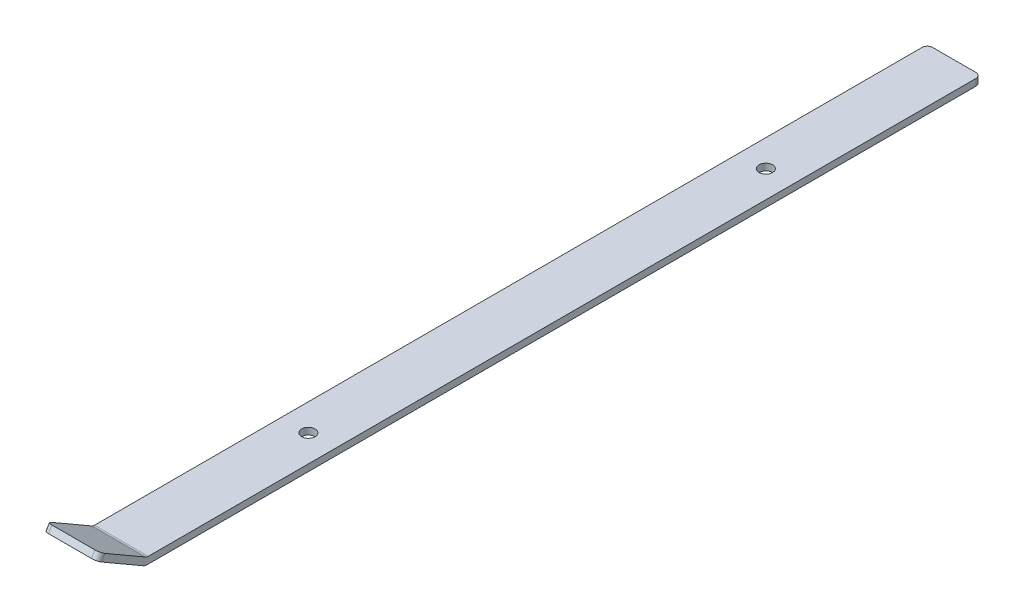
ISO-10303-21;
HEADER;
FILE_DESCRIPTION(('STEP AP214'),'2;1');
FILE_NAME('part.step','',(''),(''),'','','');
FILE_SCHEMA(('AUTOMOTIVE_DESIGN { 1 0 10303 214 1 1 1 1 }'));
ENDSEC;
DATA;
#1=APPLICATION_CONTEXT('core data for automotive mechanical design processes');
#2=APPLICATION_PROTOCOL_DEFINITION('international standard','automotive_design',2000,#1);
#3=PRODUCT_CONTEXT('',#1,'mechanical');
#4=PRODUCT('Part','Part','',(#3));
#5=PRODUCT_RELATED_PRODUCT_CATEGORY('part','',(#4));
#6=PRODUCT_DEFINITION_FORMATION('','',#4);
#7=PRODUCT_DEFINITION_CONTEXT('part definition',#1,'design');
#8=PRODUCT_DEFINITION('design','',#6,#7);
#9=PRODUCT_DEFINITION_SHAPE('','',#8);
#10=(LENGTH_UNIT() NAMED_UNIT(*) SI_UNIT(.MILLI.,.METRE.));
#11=(NAMED_UNIT(*) PLANE_ANGLE_UNIT() SI_UNIT($,.RADIAN.));
#12=(NAMED_UNIT(*) SI_UNIT($,.STERADIAN.) SOLID_ANGLE_UNIT());
#13=UNCERTAINTY_MEASURE_WITH_UNIT(LENGTH_MEASURE(1.E-05),#10,'distance_accuracy_value','');
#14=(GEOMETRIC_REPRESENTATION_CONTEXT(3) GLOBAL_UNCERTAINTY_ASSIGNED_CONTEXT((#13)) GLOBAL_UNIT_ASSIGNED_CONTEXT((#10,
#11,#12)) REPRESENTATION_CONTEXT('',''));
#15=CARTESIAN_POINT('',(0.,0.,0.));
#16=DIRECTION('',(0.,0.,1.));
#17=DIRECTION('',(1.,0.,0.));
#18=AXIS2_PLACEMENT_3D('',#15,#16,#17);
#19=CARTESIAN_POINT('',(25.4,0.,0.));
#20=DIRECTION('',(0.,-1.,0.));
#21=DIRECTION('',(0.,0.,-1.));
#22=AXIS2_PLACEMENT_3D('',#19,#20,#21);
#23=PLANE('',#22);
#24=CARTESIAN_POINT('',(12.7,0.,-88.9));
#25=DIRECTION('',(0.,1.,0.));
#26=DIRECTION('',(0.,0.,1.));
#27=AXIS2_PLACEMENT_3D('',#24,#25,#26);
#28=CIRCLE('',#27,3.175);
#29=CARTESIAN_POINT('',(12.7,0.,-85.725));
#30=VERTEX_POINT('',#29);
#31=EDGE_CURVE('E280',#30,#30,#28,.T.);
#32=ORIENTED_EDGE('',*,*,#31,.F.);
#33=EDGE_LOOP('',(#32));
#34=FACE_BOUND('',#33,.T.);
#35=CARTESIAN_POINT('',(12.7,0.,-304.8));
#36=DIRECTION('',(0.,1.,0.));
#37=DIRECTION('',(0.,0.,1.));
#38=AXIS2_PLACEMENT_3D('',#35,#36,#37);
#39=CIRCLE('',#38,3.175);
#40=CARTESIAN_POINT('',(12.7,0.,-301.625));
#41=VERTEX_POINT('',#40);
#42=EDGE_CURVE('E272',#41,#41,#39,.T.);
#43=ORIENTED_EDGE('',*,*,#42,.F.);
#44=EDGE_LOOP('',(#43));
#45=FACE_BOUND('',#44,.T.);
#46=DIRECTION('',(-1.,0.,0.));
#47=VECTOR('',#46,1.);
#48=CARTESIAN_POINT('',(25.4,0.,-393.7));
#49=LINE('',#48,#47);
#50=CARTESIAN_POINT('',(22.86,0.,-393.7));
#51=VERTEX_POINT('',#50);
#52=CARTESIAN_POINT('',(2.54,0.,-393.7));
#53=VERTEX_POINT('',#52);
#54=EDGE_CURVE('E162',#51,#53,#49,.T.);
#55=ORIENTED_EDGE('',*,*,#54,.T.);
#56=CARTESIAN_POINT('',(2.54,0.,-391.16));
#57=DIRECTION('',(0.,-1.,0.));
#58=DIRECTION('',(0.,0.,-1.));
#59=AXIS2_PLACEMENT_3D('',#56,#57,#58);
#60=CIRCLE('',#59,2.54);
#61=CARTESIAN_POINT('',(0.,0.,-391.16));
#62=VERTEX_POINT('',#61);
#63=EDGE_CURVE('E211',#53,#62,#60,.F.);
#64=ORIENTED_EDGE('',*,*,#63,.T.);
#65=DIRECTION('',(0.,0.,1.));
#66=VECTOR('',#65,1.);
#67=CARTESIAN_POINT('',(0.,0.,0.));
#68=LINE('',#67,#66);
#69=CARTESIAN_POINT('',(0.,0.,-0.680590948775043));
#70=VERTEX_POINT('',#69);
#71=EDGE_CURVE('E166',#62,#70,#68,.T.);
#72=ORIENTED_EDGE('',*,*,#71,.T.);
#73=DIRECTION('',(-1.,0.,0.));
#74=VECTOR('',#73,1.);
#75=CARTESIAN_POINT('',(25.4,0.,-0.680590948775043));
#76=LINE('',#75,#74);
#77=CARTESIAN_POINT('',(25.4,0.,-0.680590948775043));
#78=VERTEX_POINT('',#77);
#79=EDGE_CURVE('E205',#70,#78,#76,.F.);
#80=ORIENTED_EDGE('',*,*,#79,.T.);
#81=DIRECTION('',(0.,0.,1.));
#82=VECTOR('',#81,1.);
#83=CARTESIAN_POINT('',(25.4,0.,0.));
#84=LINE('',#83,#82);
#85=CARTESIAN_POINT('',(25.4,0.,-391.16));
#86=VERTEX_POINT('',#85);
#87=EDGE_CURVE('E183',#86,#78,#84,.T.);
#88=ORIENTED_EDGE('',*,*,#87,.F.);
#89=CARTESIAN_POINT('',(22.86,0.,-391.16));
#90=DIRECTION('',(0.,-1.,0.));
#91=DIRECTION('',(0.,0.,-1.));
#92=AXIS2_PLACEMENT_3D('',#89,#90,#91);
#93=CIRCLE('',#92,2.54);
#94=EDGE_CURVE('E208',#86,#51,#93,.F.);
#95=ORIENTED_EDGE('',*,*,#94,.T.);
#96=EDGE_LOOP('',(#55,#64,#72,#80,#88,#95));
#97=FACE_BOUND('',#96,.T.);
#98=ADVANCED_FACE('F38',(#34,#45,#97),#23,.F.);
#99=CARTESIAN_POINT('',(25.4,0.,0.));
#100=DIRECTION('',(0.,-0.866025403784442,0.499999999999995));
#101=DIRECTION('',(0.,-0.499999999999995,-0.866025403784442));
#102=AXIS2_PLACEMENT_3D('',#99,#100,#101);
#103=PLANE('',#102);
#104=DIRECTION('',(0.,0.499999999999995,0.866025403784442));
#105=VECTOR('',#104,1.);
#106=CARTESIAN_POINT('',(0.,0.,0.));
#107=LINE('',#106,#105);
#108=CARTESIAN_POINT('',(0.,0.340295474387518,0.589409051224943));
#109=VERTEX_POINT('',#108);
#110=CARTESIAN_POINT('',(0.,11.4299999999999,19.7973407305123));
#111=VERTEX_POINT('',#110);
#112=EDGE_CURVE('E170',#109,#111,#107,.T.);
#113=ORIENTED_EDGE('',*,*,#112,.T.);
#114=CARTESIAN_POINT('',(2.54,11.4299999999999,19.7973407305123));
#115=DIRECTION('',(0.,-0.866025403784442,0.499999999999995));
#116=DIRECTION('',(0.,-0.499999999999995,-0.866025403784442));
#117=AXIS2_PLACEMENT_3D('',#114,#115,#116);
#118=CIRCLE('',#117,2.54);
#119=CARTESIAN_POINT('',(2.54,12.6999999999999,21.9970452561248));
#120=VERTEX_POINT('',#119);
#121=EDGE_CURVE('E54',#111,#120,#118,.F.);
#122=ORIENTED_EDGE('',*,*,#121,.T.);
#123=DIRECTION('',(-1.,0.,0.));
#124=VECTOR('',#123,1.);
#125=CARTESIAN_POINT('',(25.4,12.6999999999999,21.9970452561248));
#126=LINE('',#125,#124);
#127=CARTESIAN_POINT('',(22.86,12.6999999999999,21.9970452561248));
#128=VERTEX_POINT('',#127);
#129=EDGE_CURVE('E195',#128,#120,#126,.T.);
#130=ORIENTED_EDGE('',*,*,#129,.F.);
#131=CARTESIAN_POINT('',(22.86,11.4299999999999,19.7973407305123));
#132=DIRECTION('',(0.,-0.866025403784442,0.499999999999995));
#133=DIRECTION('',(0.,-0.499999999999995,-0.866025403784442));
#134=AXIS2_PLACEMENT_3D('',#131,#132,#133);
#135=CIRCLE('',#134,2.54);
#136=CARTESIAN_POINT('',(25.4,11.4299999999999,19.7973407305123));
#137=VERTEX_POINT('',#136);
#138=EDGE_CURVE('E248',#128,#137,#135,.F.);
#139=ORIENTED_EDGE('',*,*,#138,.T.);
#140=DIRECTION('',(0.,0.499999999999995,0.866025403784442));
#141=VECTOR('',#140,1.);
#142=CARTESIAN_POINT('',(25.4,0.,0.));
#143=LINE('',#142,#141);
#144=CARTESIAN_POINT('',(25.4,0.340295474387518,0.589409051224943));
#145=VERTEX_POINT('',#144);
#146=EDGE_CURVE('E141',#145,#137,#143,.T.);
#147=ORIENTED_EDGE('',*,*,#146,.F.);
#148=DIRECTION('',(-1.,0.,0.));
#149=VECTOR('',#148,1.);
#150=CARTESIAN_POINT('',(0.,0.340295474387518,0.589409051224943));
#151=LINE('',#150,#149);
#152=EDGE_CURVE('E244',#145,#109,#151,.T.);
#153=ORIENTED_EDGE('',*,*,#152,.T.);
#154=EDGE_LOOP('',(#113,#122,#130,#139,#147,#153));
#155=FACE_BOUND('',#154,.T.);
#156=ADVANCED_FACE('F266',(#155),#103,.F.);
#157=CARTESIAN_POINT('',(25.4,12.6999999999999,21.9970452561248));
#158=DIRECTION('',(0.,-0.499999999999992,-0.866025403784443));
#159=DIRECTION('',(0.,0.866025403784443,-0.499999999999992));
#160=AXIS2_PLACEMENT_3D('',#157,#158,#159);
#161=PLANE('',#160);
#162=ORIENTED_EDGE('',*,*,#129,.T.);
#163=DIRECTION('',(0.,-0.866025403784443,0.499999999999992));
#164=VECTOR('',#163,1.);
#165=CARTESIAN_POINT('',(2.54,9.95036934298425,23.5845452561248));
#166=LINE('',#165,#164);
#167=CARTESIAN_POINT('',(2.54,9.95036934298425,23.5845452561248));
#168=VERTEX_POINT('',#167);
#169=EDGE_CURVE('E234',#120,#168,#166,.T.);
#170=ORIENTED_EDGE('',*,*,#169,.T.);
#171=DIRECTION('',(-1.,0.,0.));
#172=VECTOR('',#171,1.);
#173=CARTESIAN_POINT('',(25.4,9.95036934298425,23.5845452561248));
#174=LINE('',#173,#172);
#175=CARTESIAN_POINT('',(22.86,9.95036934298425,23.5845452561248));
#176=VERTEX_POINT('',#175);
#177=EDGE_CURVE('E152',#176,#168,#174,.T.);
#178=ORIENTED_EDGE('',*,*,#177,.F.);
#179=DIRECTION('',(0.,-0.866025403784443,0.499999999999992));
#180=VECTOR('',#179,1.);
#181=CARTESIAN_POINT('',(22.86,12.6999999999999,21.9970452561248));
#182=LINE('',#181,#180);
#183=EDGE_CURVE('E61',#176,#128,#182,.F.);
#184=ORIENTED_EDGE('',*,*,#183,.T.);
#185=EDGE_LOOP('',(#162,#170,#178,#184));
#186=FACE_BOUND('',#185,.T.);
#187=ADVANCED_FACE('F325',(#186),#161,.F.);
#188=CARTESIAN_POINT('',(25.4,9.95036934298425,23.5845452561248));
#189=DIRECTION('',(0.,0.866025403784442,-0.499999999999994));
#190=DIRECTION('',(0.,0.499999999999995,0.866025403784442));
#191=AXIS2_PLACEMENT_3D('',#188,#189,#190);
#192=PLANE('',#191);
#193=ORIENTED_EDGE('',*,*,#177,.T.);
#194=CARTESIAN_POINT('',(2.54,8.68036934298426,21.3848407305123));
#195=DIRECTION('',(0.,0.866025403784442,-0.499999999999994));
#196=DIRECTION('',(0.,0.499999999999995,0.866025403784442));
#197=AXIS2_PLACEMENT_3D('',#194,#195,#196);
#198=CIRCLE('',#197,2.54);
#199=CARTESIAN_POINT('',(0.,8.68036934298426,21.3848407305123));
#200=VERTEX_POINT('',#199);
#201=EDGE_CURVE('E241',#168,#200,#198,.F.);
#202=ORIENTED_EDGE('',*,*,#201,.T.);
#203=DIRECTION('',(0.,-0.499999999999994,-0.866025403784442));
#204=VECTOR('',#203,1.);
#205=CARTESIAN_POINT('',(0.,9.95036934298425,23.5845452561248));
#206=LINE('',#205,#204);
#207=CARTESIAN_POINT('',(0.,-2.7496306570156,1.58749999999998));
#208=VERTEX_POINT('',#207);
#209=EDGE_CURVE('E148',#200,#208,#206,.T.);
#210=ORIENTED_EDGE('',*,*,#209,.T.);
#211=DIRECTION('',(-1.,0.,0.));
#212=VECTOR('',#211,1.);
#213=CARTESIAN_POINT('',(25.4,-2.7496306570156,1.58749999999998));
#214=LINE('',#213,#212);
#215=CARTESIAN_POINT('',(25.4,-2.7496306570156,1.58749999999998));
#216=VERTEX_POINT('',#215);
#217=EDGE_CURVE('E144',#216,#208,#214,.T.);
#218=ORIENTED_EDGE('',*,*,#217,.F.);
#219=DIRECTION('',(0.,-0.499999999999994,-0.866025403784442));
#220=VECTOR('',#219,1.);
#221=CARTESIAN_POINT('',(25.4,9.95036934298425,23.5845452561248));
#222=LINE('',#221,#220);
#223=CARTESIAN_POINT('',(25.4,8.68036934298426,21.3848407305123));
#224=VERTEX_POINT('',#223);
#225=EDGE_CURVE('E129',#224,#216,#222,.T.);
#226=ORIENTED_EDGE('',*,*,#225,.F.);
#227=CARTESIAN_POINT('',(22.86,8.68036934298426,21.3848407305123));
#228=DIRECTION('',(0.,0.866025403784442,-0.499999999999994));
#229=DIRECTION('',(0.,0.499999999999995,0.866025403784442));
#230=AXIS2_PLACEMENT_3D('',#227,#228,#229);
#231=CIRCLE('',#230,2.54);
#232=EDGE_CURVE('E238',#224,#176,#231,.F.);
#233=ORIENTED_EDGE('',*,*,#232,.T.);
#234=EDGE_LOOP('',(#193,#202,#210,#218,#226,#233));
#235=FACE_BOUND('',#234,.T.);
#236=ADVANCED_FACE('F146',(#235),#192,.F.);
#237=CARTESIAN_POINT('',(25.4,0.,0.));
#238=DIRECTION('',(-1.,0.,0.));
#239=DIRECTION('',(0.,0.,1.));
#240=AXIS2_PLACEMENT_3D('',#237,#238,#239);
#241=CYLINDRICAL_SURFACE('',#240,3.175);
#242=CARTESIAN_POINT('',(0.,0.,0.));
#243=DIRECTION('',(1.,0.,0.));
#244=DIRECTION('',(0.,0.,1.));
#245=AXIS2_PLACEMENT_3D('',#242,#243,#244);
#246=CIRCLE('',#245,3.175);
#247=CARTESIAN_POINT('',(0.,-3.175,0.));
#248=VERTEX_POINT('',#247);
#249=EDGE_CURVE('E176',#208,#248,#246,.T.);
#250=ORIENTED_EDGE('',*,*,#249,.T.);
#251=DIRECTION('',(-1.,0.,0.));
#252=VECTOR('',#251,1.);
#253=CARTESIAN_POINT('',(25.4,-3.175,0.));
#254=LINE('',#253,#252);
#255=CARTESIAN_POINT('',(25.4,-3.175,0.));
#256=VERTEX_POINT('',#255);
#257=EDGE_CURVE('E153',#256,#248,#254,.T.);
#258=ORIENTED_EDGE('',*,*,#257,.F.);
#259=CARTESIAN_POINT('',(25.4,0.,0.));
#260=DIRECTION('',(1.,0.,0.));
#261=DIRECTION('',(0.,0.,1.));
#262=AXIS2_PLACEMENT_3D('',#259,#260,#261);
#263=CIRCLE('',#262,3.175);
#264=EDGE_CURVE('E134',#216,#256,#263,.T.);
#265=ORIENTED_EDGE('',*,*,#264,.F.);
#266=ORIENTED_EDGE('',*,*,#217,.T.);
#267=EDGE_LOOP('',(#250,#258,#265,#266));
#268=FACE_BOUND('',#267,.T.);
#269=ADVANCED_FACE('F155',(#268),#241,.T.);
#270=CARTESIAN_POINT('',(25.4,-3.175,0.));
#271=DIRECTION('',(0.,1.,0.));
#272=DIRECTION('',(0.,0.,1.));
#273=AXIS2_PLACEMENT_3D('',#270,#271,#272);
#274=PLANE('',#273);
#275=CARTESIAN_POINT('',(12.7,-3.175,-88.9));
#276=DIRECTION('',(0.,1.,0.));
#277=DIRECTION('',(0.,0.,1.));
#278=AXIS2_PLACEMENT_3D('',#275,#276,#277);
#279=CIRCLE('',#278,3.175);
#280=CARTESIAN_POINT('',(12.7,-3.175,-85.725));
#281=VERTEX_POINT('',#280);
#282=EDGE_CURVE('E171',#281,#281,#279,.T.);
#283=ORIENTED_EDGE('',*,*,#282,.T.);
#284=EDGE_LOOP('',(#283));
#285=FACE_BOUND('',#284,.T.);
#286=CARTESIAN_POINT('',(12.7,-3.175,-304.8));
#287=DIRECTION('',(0.,1.,0.));
#288=DIRECTION('',(0.,0.,1.));
#289=AXIS2_PLACEMENT_3D('',#286,#287,#288);
#290=CIRCLE('',#289,3.175);
#291=CARTESIAN_POINT('',(12.7,-3.175,-301.625));
#292=VERTEX_POINT('',#291);
#293=EDGE_CURVE('E276',#292,#292,#290,.T.);
#294=ORIENTED_EDGE('',*,*,#293,.T.);
#295=EDGE_LOOP('',(#294));
#296=FACE_BOUND('',#295,.T.);
#297=DIRECTION('',(0.,0.,-1.));
#298=VECTOR('',#297,1.);
#299=CARTESIAN_POINT('',(0.,-3.175,0.));
#300=LINE('',#299,#298);
#301=CARTESIAN_POINT('',(0.,-3.175,-391.16));
#302=VERTEX_POINT('',#301);
#303=EDGE_CURVE('E179',#248,#302,#300,.T.);
#304=ORIENTED_EDGE('',*,*,#303,.T.);
#305=CARTESIAN_POINT('',(2.54,-3.175,-391.16));
#306=DIRECTION('',(0.,1.,0.));
#307=DIRECTION('',(0.,0.,1.));
#308=AXIS2_PLACEMENT_3D('',#305,#306,#307);
#309=CIRCLE('',#308,2.54);
#310=CARTESIAN_POINT('',(2.54,-3.175,-393.7));
#311=VERTEX_POINT('',#310);
#312=EDGE_CURVE('E223',#302,#311,#309,.F.);
#313=ORIENTED_EDGE('',*,*,#312,.T.);
#314=DIRECTION('',(-1.,0.,0.));
#315=VECTOR('',#314,1.);
#316=CARTESIAN_POINT('',(25.4,-3.175,-393.7));
#317=LINE('',#316,#315);
#318=CARTESIAN_POINT('',(22.86,-3.175,-393.7));
#319=VERTEX_POINT('',#318);
#320=EDGE_CURVE('E187',#319,#311,#317,.T.);
#321=ORIENTED_EDGE('',*,*,#320,.F.);
#322=CARTESIAN_POINT('',(22.86,-3.175,-391.16));
#323=DIRECTION('',(0.,1.,0.));
#324=DIRECTION('',(0.,0.,1.));
#325=AXIS2_PLACEMENT_3D('',#322,#323,#324);
#326=CIRCLE('',#325,2.54);
#327=CARTESIAN_POINT('',(25.4,-3.175,-391.16));
#328=VERTEX_POINT('',#327);
#329=EDGE_CURVE('E220',#319,#328,#326,.F.);
#330=ORIENTED_EDGE('',*,*,#329,.T.);
#331=DIRECTION('',(0.,0.,-1.));
#332=VECTOR('',#331,1.);
#333=CARTESIAN_POINT('',(25.4,-3.175,0.));
#334=LINE('',#333,#332);
#335=EDGE_CURVE('E159',#256,#328,#334,.T.);
#336=ORIENTED_EDGE('',*,*,#335,.F.);
#337=ORIENTED_EDGE('',*,*,#257,.T.);
#338=EDGE_LOOP('',(#304,#313,#321,#330,#336,#337));
#339=FACE_BOUND('',#338,.T.);
#340=ADVANCED_FACE('F288',(#285,#296,#339),#274,.F.);
#341=CARTESIAN_POINT('',(25.4,0.,-393.7));
#342=DIRECTION('',(0.,0.,1.));
#343=DIRECTION('',(1.,0.,0.));
#344=AXIS2_PLACEMENT_3D('',#341,#342,#343);
#345=PLANE('',#344);
#346=ORIENTED_EDGE('',*,*,#320,.T.);
#347=DIRECTION('',(0.,1.,0.));
#348=VECTOR('',#347,1.);
#349=CARTESIAN_POINT('',(2.54,0.,-393.7));
#350=LINE('',#349,#348);
#351=EDGE_CURVE('E201',#311,#53,#350,.T.);
#352=ORIENTED_EDGE('',*,*,#351,.T.);
#353=ORIENTED_EDGE('',*,*,#54,.F.);
#354=DIRECTION('',(0.,1.,0.));
#355=VECTOR('',#354,1.);
#356=CARTESIAN_POINT('',(22.86,0.,-393.7));
#357=LINE('',#356,#355);
#358=EDGE_CURVE('E198',#51,#319,#357,.F.);
#359=ORIENTED_EDGE('',*,*,#358,.T.);
#360=EDGE_LOOP('',(#346,#352,#353,#359));
#361=FACE_BOUND('',#360,.T.);
#362=ADVANCED_FACE('F314',(#361),#345,.F.);
#363=CARTESIAN_POINT('',(25.4,0.,0.));
#364=DIRECTION('',(-1.,0.,0.));
#365=DIRECTION('',(0.,0.,1.));
#366=AXIS2_PLACEMENT_3D('',#363,#364,#365);
#367=PLANE('',#366);
#368=ORIENTED_EDGE('',*,*,#335,.T.);
#369=DIRECTION('',(0.,1.,0.));
#370=VECTOR('',#369,1.);
#371=CARTESIAN_POINT('',(25.4,0.,-391.16));
#372=LINE('',#371,#370);
#373=EDGE_CURVE('E228',#328,#86,#372,.T.);
#374=ORIENTED_EDGE('',*,*,#373,.T.);
#375=ORIENTED_EDGE('',*,*,#87,.T.);
#376=CARTESIAN_POINT('',(25.4,2.54,-0.680590948775043));
#377=DIRECTION('',(-1.,0.,0.));
#378=DIRECTION('',(0.,0.,1.));
#379=AXIS2_PLACEMENT_3D('',#376,#377,#378);
#380=CIRCLE('',#379,2.54);
#381=EDGE_CURVE('E11',#78,#145,#380,.T.);
#382=ORIENTED_EDGE('',*,*,#381,.T.);
#383=ORIENTED_EDGE('',*,*,#146,.T.);
#384=DIRECTION('',(0.,-0.866025403784443,0.499999999999992));
#385=VECTOR('',#384,1.);
#386=CARTESIAN_POINT('',(25.4,11.4299999999998,19.7973407305124));
#387=LINE('',#386,#385);
#388=EDGE_CURVE('E138',#137,#224,#387,.T.);
#389=ORIENTED_EDGE('',*,*,#388,.T.);
#390=ORIENTED_EDGE('',*,*,#225,.T.);
#391=ORIENTED_EDGE('',*,*,#264,.T.);
#392=EDGE_LOOP('',(#368,#374,#375,#382,#383,#389,#390,#391));
#393=FACE_BOUND('',#392,.T.);
#394=ADVANCED_FACE('F132',(#393),#367,.F.);
#395=CARTESIAN_POINT('',(0.,0.,0.));
#396=DIRECTION('',(-1.,0.,0.));
#397=DIRECTION('',(0.,0.,1.));
#398=AXIS2_PLACEMENT_3D('',#395,#396,#397);
#399=PLANE('',#398);
#400=ORIENTED_EDGE('',*,*,#71,.F.);
#401=DIRECTION('',(0.,1.,0.));
#402=VECTOR('',#401,1.);
#403=CARTESIAN_POINT('',(0.,-3.175,-391.16));
#404=LINE('',#403,#402);
#405=EDGE_CURVE('E217',#62,#302,#404,.F.);
#406=ORIENTED_EDGE('',*,*,#405,.T.);
#407=ORIENTED_EDGE('',*,*,#303,.F.);
#408=ORIENTED_EDGE('',*,*,#249,.F.);
#409=ORIENTED_EDGE('',*,*,#209,.F.);
#410=DIRECTION('',(0.,-0.866025403784443,0.499999999999992));
#411=VECTOR('',#410,1.);
#412=CARTESIAN_POINT('',(0.,11.4299999999999,19.7973407305123));
#413=LINE('',#412,#411);
#414=EDGE_CURVE('E214',#200,#111,#413,.F.);
#415=ORIENTED_EDGE('',*,*,#414,.T.);
#416=ORIENTED_EDGE('',*,*,#112,.F.);
#417=CARTESIAN_POINT('',(0.,2.54,-0.680590948775043));
#418=DIRECTION('',(-1.,0.,0.));
#419=DIRECTION('',(0.,0.,1.));
#420=AXIS2_PLACEMENT_3D('',#417,#418,#419);
#421=CIRCLE('',#420,2.54);
#422=EDGE_CURVE('E47',#109,#70,#421,.F.);
#423=ORIENTED_EDGE('',*,*,#422,.T.);
#424=EDGE_LOOP('',(#400,#406,#407,#408,#409,#415,#416,#423));
#425=FACE_BOUND('',#424,.T.);
#426=ADVANCED_FACE('F256',(#425),#399,.T.);
#427=CARTESIAN_POINT('',(12.7,-3.175,-304.8));
#428=DIRECTION('',(0.,1.,0.));
#429=DIRECTION('',(0.,0.,1.));
#430=AXIS2_PLACEMENT_3D('',#427,#428,#429);
#431=CYLINDRICAL_SURFACE('',#430,3.175);
#432=ORIENTED_EDGE('',*,*,#293,.F.);
#433=EDGE_LOOP('',(#432));
#434=FACE_BOUND('',#433,.T.);
#435=ORIENTED_EDGE('',*,*,#42,.T.);
#436=EDGE_LOOP('',(#435));
#437=FACE_BOUND('',#436,.T.);
#438=ADVANCED_FACE('F295',(#434,#437),#431,.F.);
#439=CARTESIAN_POINT('',(12.7,-3.175,-88.9));
#440=DIRECTION('',(0.,1.,0.));
#441=DIRECTION('',(0.,0.,1.));
#442=AXIS2_PLACEMENT_3D('',#439,#440,#441);
#443=CYLINDRICAL_SURFACE('',#442,3.175);
#444=ORIENTED_EDGE('',*,*,#282,.F.);
#445=EDGE_LOOP('',(#444));
#446=FACE_BOUND('',#445,.T.);
#447=ORIENTED_EDGE('',*,*,#31,.T.);
#448=EDGE_LOOP('',(#447));
#449=FACE_BOUND('',#448,.T.);
#450=ADVANCED_FACE('F291',(#446,#449),#443,.F.);
#451=CARTESIAN_POINT('',(2.54,0.,-391.16));
#452=DIRECTION('',(0.,-1.,0.));
#453=DIRECTION('',(0.,0.,-1.));
#454=AXIS2_PLACEMENT_3D('',#451,#452,#453);
#455=CYLINDRICAL_SURFACE('',#454,2.54);
#456=ORIENTED_EDGE('',*,*,#312,.F.);
#457=ORIENTED_EDGE('',*,*,#405,.F.);
#458=ORIENTED_EDGE('',*,*,#63,.F.);
#459=ORIENTED_EDGE('',*,*,#351,.F.);
#460=EDGE_LOOP('',(#456,#457,#458,#459));
#461=FACE_BOUND('',#460,.T.);
#462=ADVANCED_FACE('F294',(#461),#455,.T.);
#463=CARTESIAN_POINT('',(22.86,0.,-391.16));
#464=DIRECTION('',(0.,1.,0.));
#465=DIRECTION('',(0.,0.,1.));
#466=AXIS2_PLACEMENT_3D('',#463,#464,#465);
#467=CYLINDRICAL_SURFACE('',#466,2.54);
#468=ORIENTED_EDGE('',*,*,#329,.F.);
#469=ORIENTED_EDGE('',*,*,#358,.F.);
#470=ORIENTED_EDGE('',*,*,#94,.F.);
#471=ORIENTED_EDGE('',*,*,#373,.F.);
#472=EDGE_LOOP('',(#468,#469,#470,#471));
#473=FACE_BOUND('',#472,.T.);
#474=ADVANCED_FACE('F332',(#473),#467,.T.);
#475=CARTESIAN_POINT('',(2.54,11.4299999999999,19.7973407305123));
#476=DIRECTION('',(0.,0.866025403784443,-0.499999999999992));
#477=DIRECTION('',(0.,0.499999999999992,0.866025403784443));
#478=AXIS2_PLACEMENT_3D('',#475,#476,#477);
#479=CYLINDRICAL_SURFACE('',#478,2.54);
#480=ORIENTED_EDGE('',*,*,#121,.F.);
#481=ORIENTED_EDGE('',*,*,#414,.F.);
#482=ORIENTED_EDGE('',*,*,#201,.F.);
#483=ORIENTED_EDGE('',*,*,#169,.F.);
#484=EDGE_LOOP('',(#480,#481,#482,#483));
#485=FACE_BOUND('',#484,.T.);
#486=ADVANCED_FACE('F336',(#485),#479,.T.);
#487=CARTESIAN_POINT('',(22.86,11.4299999999998,19.7973407305124));
#488=DIRECTION('',(0.,-0.866025403784443,0.499999999999992));
#489=DIRECTION('',(0.,-0.499999999999992,-0.866025403784443));
#490=AXIS2_PLACEMENT_3D('',#487,#488,#489);
#491=CYLINDRICAL_SURFACE('',#490,2.54);
#492=ORIENTED_EDGE('',*,*,#138,.F.);
#493=ORIENTED_EDGE('',*,*,#183,.F.);
#494=ORIENTED_EDGE('',*,*,#232,.F.);
#495=ORIENTED_EDGE('',*,*,#388,.F.);
#496=EDGE_LOOP('',(#492,#493,#494,#495));
#497=FACE_BOUND('',#496,.T.);
#498=ADVANCED_FACE('F339',(#497),#491,.T.);
#499=CARTESIAN_POINT('',(25.4,2.54,-0.680590948775043));
#500=DIRECTION('',(1.,0.,0.));
#501=DIRECTION('',(0.,0.,-1.));
#502=AXIS2_PLACEMENT_3D('',#499,#500,#501);
#503=CYLINDRICAL_SURFACE('',#502,2.54);
#504=ORIENTED_EDGE('',*,*,#381,.F.);
#505=ORIENTED_EDGE('',*,*,#79,.F.);
#506=ORIENTED_EDGE('',*,*,#422,.F.);
#507=ORIENTED_EDGE('',*,*,#152,.F.);
#508=EDGE_LOOP('',(#504,#505,#506,#507));
#509=FACE_BOUND('',#508,.T.);
#510=ADVANCED_FACE('F40',(#509),#503,.F.);
#511=CLOSED_SHELL('',(#98,#156,#187,#236,#269,#340,#362,#394,#426,#438,#450,#462,#474,#486,#498,#510));
#512=MANIFOLD_SOLID_BREP('B2',#511);
#513=ADVANCED_BREP_SHAPE_REPRESENTATION('',(#18,#512),#14);
#514=SHAPE_DEFINITION_REPRESENTATION(#9,#513);
ENDSEC;
END-ISO-10303-21;
